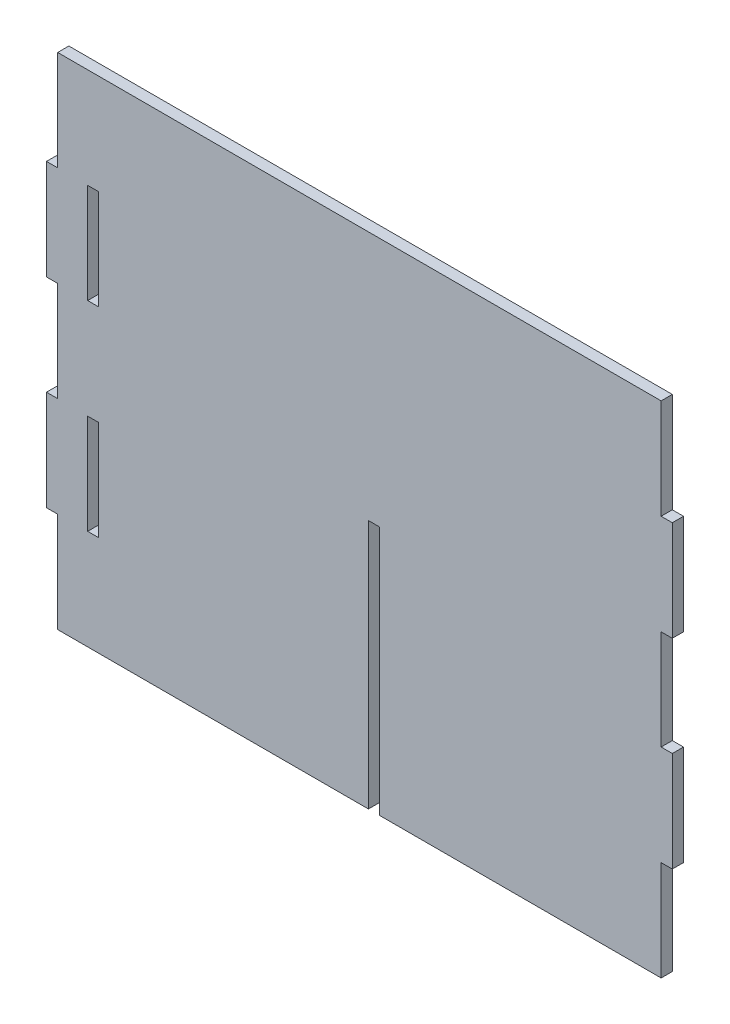
ISO-10303-21;
HEADER;
FILE_DESCRIPTION(('STEP AP214'),'2;1');
FILE_NAME('part.step','',(''),(''),'','','');
FILE_SCHEMA(('AUTOMOTIVE_DESIGN { 1 0 10303 214 1 1 1 1 }'));
ENDSEC;
DATA;
#1=APPLICATION_CONTEXT('core data for automotive mechanical design processes');
#2=APPLICATION_PROTOCOL_DEFINITION('international standard','automotive_design',2000,#1);
#3=PRODUCT_CONTEXT('',#1,'mechanical');
#4=PRODUCT('Part','Part','',(#3));
#5=PRODUCT_RELATED_PRODUCT_CATEGORY('part','',(#4));
#6=PRODUCT_DEFINITION_FORMATION('','',#4);
#7=PRODUCT_DEFINITION_CONTEXT('part definition',#1,'design');
#8=PRODUCT_DEFINITION('design','',#6,#7);
#9=PRODUCT_DEFINITION_SHAPE('','',#8);
#10=(LENGTH_UNIT() NAMED_UNIT(*) SI_UNIT(.MILLI.,.METRE.));
#11=(NAMED_UNIT(*) PLANE_ANGLE_UNIT() SI_UNIT($,.RADIAN.));
#12=(NAMED_UNIT(*) SI_UNIT($,.STERADIAN.) SOLID_ANGLE_UNIT());
#13=UNCERTAINTY_MEASURE_WITH_UNIT(LENGTH_MEASURE(1.E-05),#10,'distance_accuracy_value','');
#14=(GEOMETRIC_REPRESENTATION_CONTEXT(3) GLOBAL_UNCERTAINTY_ASSIGNED_CONTEXT((#13)) GLOBAL_UNIT_ASSIGNED_CONTEXT((#10,
#11,#12)) REPRESENTATION_CONTEXT('',''));
#15=CARTESIAN_POINT('',(0.,0.,0.));
#16=DIRECTION('',(0.,0.,1.));
#17=DIRECTION('',(1.,0.,0.));
#18=AXIS2_PLACEMENT_3D('',#15,#16,#17);
#19=CARTESIAN_POINT('',(-131.24686,24.17314,-386.827934387987));
#20=DIRECTION('',(0.,-1.,0.));
#21=DIRECTION('',(0.,0.,-1.));
#22=AXIS2_PLACEMENT_3D('',#19,#20,#21);
#23=PLANE('',#22);
#24=DIRECTION('',(0.,0.,1.));
#25=VECTOR('',#24,1.);
#26=CARTESIAN_POINT('',(-125.92814,24.17314,-386.827934387987));
#27=LINE('',#26,#25);
#28=CARTESIAN_POINT('',(-125.92814,24.17314,0.));
#29=VERTEX_POINT('',#28);
#30=CARTESIAN_POINT('',(-125.92814,24.17314,5.4));
#31=VERTEX_POINT('',#30);
#32=EDGE_CURVE('E318',#29,#31,#27,.T.);
#33=ORIENTED_EDGE('',*,*,#32,.F.);
#34=DIRECTION('',(-1.,0.,0.));
#35=VECTOR('',#34,1.);
#36=CARTESIAN_POINT('',(-131.24686,24.17314,0.));
#37=LINE('',#36,#35);
#38=CARTESIAN_POINT('',(-131.24686,24.17314,0.));
#39=VERTEX_POINT('',#38);
#40=EDGE_CURVE('E61',#29,#39,#37,.T.);
#41=ORIENTED_EDGE('',*,*,#40,.T.);
#42=DIRECTION('',(0.,0.,1.));
#43=VECTOR('',#42,1.);
#44=CARTESIAN_POINT('',(-131.24686,24.17314,-386.827934387987));
#45=LINE('',#44,#43);
#46=CARTESIAN_POINT('',(-131.24686,24.17314,5.4));
#47=VERTEX_POINT('',#46);
#48=EDGE_CURVE('E310',#39,#47,#45,.T.);
#49=ORIENTED_EDGE('',*,*,#48,.T.);
#50=DIRECTION('',(1.,0.,0.));
#51=VECTOR('',#50,1.);
#52=CARTESIAN_POINT('',(-131.24686,24.17314,5.4));
#53=LINE('',#52,#51);
#54=EDGE_CURVE('E298',#47,#31,#53,.T.);
#55=ORIENTED_EDGE('',*,*,#54,.T.);
#56=EDGE_LOOP('',(#33,#41,#49,#55));
#57=FACE_BOUND('',#56,.T.);
#58=ADVANCED_FACE('F41',(#57),#23,.F.);
#59=CARTESIAN_POINT('',(-125.92814,24.17314,-386.827934387987));
#60=DIRECTION('',(1.,0.,0.));
#61=DIRECTION('',(0.,1.,0.));
#62=AXIS2_PLACEMENT_3D('',#59,#60,#61);
#63=PLANE('',#62);
#64=DIRECTION('',(0.,0.,1.));
#65=VECTOR('',#64,1.);
#66=CARTESIAN_POINT('',(-125.92814,72.35686,-386.827934387987));
#67=LINE('',#66,#65);
#68=CARTESIAN_POINT('',(-125.92814,72.35686,0.));
#69=VERTEX_POINT('',#68);
#70=CARTESIAN_POINT('',(-125.92814,72.35686,5.4));
#71=VERTEX_POINT('',#70);
#72=EDGE_CURVE('E315',#69,#71,#67,.T.);
#73=ORIENTED_EDGE('',*,*,#72,.F.);
#74=DIRECTION('',(0.,-1.,0.));
#75=VECTOR('',#74,1.);
#76=CARTESIAN_POINT('',(-125.92814,24.17314,0.));
#77=LINE('',#76,#75);
#78=EDGE_CURVE('E52',#69,#29,#77,.T.);
#79=ORIENTED_EDGE('',*,*,#78,.T.);
#80=ORIENTED_EDGE('',*,*,#32,.T.);
#81=DIRECTION('',(0.,1.,0.));
#82=VECTOR('',#81,1.);
#83=CARTESIAN_POINT('',(-125.92814,24.17314,5.4));
#84=LINE('',#83,#82);
#85=EDGE_CURVE('E302',#31,#71,#84,.T.);
#86=ORIENTED_EDGE('',*,*,#85,.T.);
#87=EDGE_LOOP('',(#73,#79,#80,#86));
#88=FACE_BOUND('',#87,.T.);
#89=ADVANCED_FACE('F712',(#88),#63,.F.);
#90=CARTESIAN_POINT('',(-125.92814,72.35686,-386.827934387987));
#91=DIRECTION('',(0.,1.,0.));
#92=DIRECTION('',(-1.,0.,0.));
#93=AXIS2_PLACEMENT_3D('',#90,#91,#92);
#94=PLANE('',#93);
#95=DIRECTION('',(0.,0.,1.));
#96=VECTOR('',#95,1.);
#97=CARTESIAN_POINT('',(-131.24686,72.35686,-386.827934387987));
#98=LINE('',#97,#96);
#99=CARTESIAN_POINT('',(-131.24686,72.35686,0.));
#100=VERTEX_POINT('',#99);
#101=CARTESIAN_POINT('',(-131.24686,72.35686,5.4));
#102=VERTEX_POINT('',#101);
#103=EDGE_CURVE('E311',#100,#102,#98,.T.);
#104=ORIENTED_EDGE('',*,*,#103,.F.);
#105=DIRECTION('',(1.,0.,0.));
#106=VECTOR('',#105,1.);
#107=CARTESIAN_POINT('',(-125.92814,72.35686,0.));
#108=LINE('',#107,#106);
#109=EDGE_CURVE('E81',#100,#69,#108,.T.);
#110=ORIENTED_EDGE('',*,*,#109,.T.);
#111=ORIENTED_EDGE('',*,*,#72,.T.);
#112=DIRECTION('',(-1.,0.,0.));
#113=VECTOR('',#112,1.);
#114=CARTESIAN_POINT('',(-125.92814,72.35686,5.4));
#115=LINE('',#114,#113);
#116=EDGE_CURVE('E306',#71,#102,#115,.T.);
#117=ORIENTED_EDGE('',*,*,#116,.T.);
#118=EDGE_LOOP('',(#104,#110,#111,#117));
#119=FACE_BOUND('',#118,.T.);
#120=ADVANCED_FACE('F718',(#119),#94,.F.);
#121=CARTESIAN_POINT('',(-131.24686,72.35686,-386.827934387987));
#122=DIRECTION('',(-1.,0.,0.));
#123=DIRECTION('',(0.,0.,1.));
#124=AXIS2_PLACEMENT_3D('',#121,#122,#123);
#125=PLANE('',#124);
#126=ORIENTED_EDGE('',*,*,#48,.F.);
#127=DIRECTION('',(0.,1.,0.));
#128=VECTOR('',#127,1.);
#129=CARTESIAN_POINT('',(-131.24686,72.35686,0.));
#130=LINE('',#129,#128);
#131=EDGE_CURVE('E534',#39,#100,#130,.T.);
#132=ORIENTED_EDGE('',*,*,#131,.T.);
#133=ORIENTED_EDGE('',*,*,#103,.T.);
#134=DIRECTION('',(0.,-1.,0.));
#135=VECTOR('',#134,1.);
#136=CARTESIAN_POINT('',(-131.24686,72.35686,5.4));
#137=LINE('',#136,#135);
#138=EDGE_CURVE('E290',#102,#47,#137,.T.);
#139=ORIENTED_EDGE('',*,*,#138,.T.);
#140=EDGE_LOOP('',(#126,#132,#133,#139));
#141=FACE_BOUND('',#140,.T.);
#142=ADVANCED_FACE('F724',(#141),#125,.F.);
#143=CARTESIAN_POINT('',(0.,0.,0.));
#144=DIRECTION('',(0.,0.,1.));
#145=DIRECTION('',(1.,0.,0.));
#146=AXIS2_PLACEMENT_3D('',#143,#144,#145);
#147=PLANE('',#146);
#148=DIRECTION('',(-1.,0.,0.));
#149=VECTOR('',#148,1.);
#150=CARTESIAN_POINT('',(-131.24686,-72.35686,0.));
#151=LINE('',#150,#149);
#152=CARTESIAN_POINT('',(-125.92814,-72.3568600000001,0.));
#153=VERTEX_POINT('',#152);
#154=CARTESIAN_POINT('',(-131.24686,-72.35686,0.));
#155=VERTEX_POINT('',#154);
#156=EDGE_CURVE('E45',#153,#155,#151,.T.);
#157=ORIENTED_EDGE('',*,*,#156,.F.);
#158=DIRECTION('',(0.,-1.,0.));
#159=VECTOR('',#158,1.);
#160=CARTESIAN_POINT('',(-125.92814,-72.3568600000001,0.));
#161=LINE('',#160,#159);
#162=CARTESIAN_POINT('',(-125.92814,-24.17314,0.));
#163=VERTEX_POINT('',#162);
#164=EDGE_CURVE('E75',#163,#153,#161,.T.);
#165=ORIENTED_EDGE('',*,*,#164,.F.);
#166=DIRECTION('',(1.,0.,0.));
#167=VECTOR('',#166,1.);
#168=CARTESIAN_POINT('',(-125.92814,-24.17314,0.));
#169=LINE('',#168,#167);
#170=CARTESIAN_POINT('',(-131.24686,-24.17314,0.));
#171=VERTEX_POINT('',#170);
#172=EDGE_CURVE('E529',#171,#163,#169,.T.);
#173=ORIENTED_EDGE('',*,*,#172,.F.);
#174=DIRECTION('',(0.,1.,0.));
#175=VECTOR('',#174,1.);
#176=CARTESIAN_POINT('',(-131.24686,-24.17314,0.));
#177=LINE('',#176,#175);
#178=EDGE_CURVE('E516',#155,#171,#177,.T.);
#179=ORIENTED_EDGE('',*,*,#178,.F.);
#180=EDGE_LOOP('',(#157,#165,#173,#179));
#181=FACE_BOUND('',#180,.T.);
#182=DIRECTION('',(0.,1.,0.));
#183=VECTOR('',#182,1.);
#184=CARTESIAN_POINT('',(-145.72814,-72.43814,0.));
#185=LINE('',#184,#183);
#186=CARTESIAN_POINT('',(-145.72814,-120.70314,0.));
#187=VERTEX_POINT('',#186);
#188=CARTESIAN_POINT('',(-145.72814,-72.43814,0.));
#189=VERTEX_POINT('',#188);
#190=EDGE_CURVE('E495',#187,#189,#185,.T.);
#191=ORIENTED_EDGE('',*,*,#190,.T.);
#192=DIRECTION('',(-1.,0.,0.));
#193=VECTOR('',#192,1.);
#194=CARTESIAN_POINT('',(-151.12814,-72.43814,0.));
#195=LINE('',#194,#193);
#196=CARTESIAN_POINT('',(-151.12814,-72.43814,0.));
#197=VERTEX_POINT('',#196);
#198=EDGE_CURVE('E508',#189,#197,#195,.T.);
#199=ORIENTED_EDGE('',*,*,#198,.T.);
#200=DIRECTION('',(0.,1.,0.));
#201=VECTOR('',#200,1.);
#202=CARTESIAN_POINT('',(-151.12814,-24.09186,0.));
#203=LINE('',#202,#201);
#204=CARTESIAN_POINT('',(-151.12814,-24.09186,0.));
#205=VERTEX_POINT('',#204);
#206=EDGE_CURVE('E512',#197,#205,#203,.T.);
#207=ORIENTED_EDGE('',*,*,#206,.T.);
#208=DIRECTION('',(1.,0.,0.));
#209=VECTOR('',#208,1.);
#210=CARTESIAN_POINT('',(-145.72814,-24.09186,0.));
#211=LINE('',#210,#209);
#212=CARTESIAN_POINT('',(-145.72814,-24.09186,0.));
#213=VERTEX_POINT('',#212);
#214=EDGE_CURVE('E518',#205,#213,#211,.T.);
#215=ORIENTED_EDGE('',*,*,#214,.T.);
#216=DIRECTION('',(0.,1.,0.));
#217=VECTOR('',#216,1.);
#218=CARTESIAN_POINT('',(-145.72814,24.09186,0.));
#219=LINE('',#218,#217);
#220=CARTESIAN_POINT('',(-145.72814,24.09186,0.));
#221=VERTEX_POINT('',#220);
#222=EDGE_CURVE('E601',#213,#221,#219,.T.);
#223=ORIENTED_EDGE('',*,*,#222,.T.);
#224=DIRECTION('',(-1.,0.,0.));
#225=VECTOR('',#224,1.);
#226=CARTESIAN_POINT('',(-151.12814,24.09186,0.));
#227=LINE('',#226,#225);
#228=CARTESIAN_POINT('',(-151.12814,24.09186,0.));
#229=VERTEX_POINT('',#228);
#230=EDGE_CURVE('E598',#221,#229,#227,.T.);
#231=ORIENTED_EDGE('',*,*,#230,.T.);
#232=DIRECTION('',(0.,1.,0.));
#233=VECTOR('',#232,1.);
#234=CARTESIAN_POINT('',(-151.12814,72.43814,0.));
#235=LINE('',#234,#233);
#236=CARTESIAN_POINT('',(-151.12814,72.43814,0.));
#237=VERTEX_POINT('',#236);
#238=EDGE_CURVE('E595',#229,#237,#235,.T.);
#239=ORIENTED_EDGE('',*,*,#238,.T.);
#240=DIRECTION('',(1.,0.,0.));
#241=VECTOR('',#240,1.);
#242=CARTESIAN_POINT('',(-145.72814,72.43814,0.));
#243=LINE('',#242,#241);
#244=CARTESIAN_POINT('',(-145.72814,72.43814,0.));
#245=VERTEX_POINT('',#244);
#246=EDGE_CURVE('E592',#237,#245,#243,.T.);
#247=ORIENTED_EDGE('',*,*,#246,.T.);
#248=DIRECTION('',(0.,1.,0.));
#249=VECTOR('',#248,1.);
#250=CARTESIAN_POINT('',(-145.72814,120.70314,0.));
#251=LINE('',#250,#249);
#252=CARTESIAN_POINT('',(-145.72814,120.70314,0.));
#253=VERTEX_POINT('',#252);
#254=EDGE_CURVE('E589',#245,#253,#251,.T.);
#255=ORIENTED_EDGE('',*,*,#254,.T.);
#256=DIRECTION('',(1.,0.,0.));
#257=VECTOR('',#256,1.);
#258=CARTESIAN_POINT('',(145.72814,120.70314,0.));
#259=LINE('',#258,#257);
#260=CARTESIAN_POINT('',(145.72814,120.70314,0.));
#261=VERTEX_POINT('',#260);
#262=EDGE_CURVE('E586',#253,#261,#259,.T.);
#263=ORIENTED_EDGE('',*,*,#262,.T.);
#264=DIRECTION('',(0.,-1.,0.));
#265=VECTOR('',#264,1.);
#266=CARTESIAN_POINT('',(145.72814,72.43814,0.));
#267=LINE('',#266,#265);
#268=CARTESIAN_POINT('',(145.72814,72.43814,0.));
#269=VERTEX_POINT('',#268);
#270=EDGE_CURVE('E583',#261,#269,#267,.T.);
#271=ORIENTED_EDGE('',*,*,#270,.T.);
#272=DIRECTION('',(1.,0.,0.));
#273=VECTOR('',#272,1.);
#274=CARTESIAN_POINT('',(151.12814,72.43814,0.));
#275=LINE('',#274,#273);
#276=CARTESIAN_POINT('',(151.12814,72.43814,0.));
#277=VERTEX_POINT('',#276);
#278=EDGE_CURVE('E580',#269,#277,#275,.T.);
#279=ORIENTED_EDGE('',*,*,#278,.T.);
#280=DIRECTION('',(0.,-1.,0.));
#281=VECTOR('',#280,1.);
#282=CARTESIAN_POINT('',(151.12814,24.09186,0.));
#283=LINE('',#282,#281);
#284=CARTESIAN_POINT('',(151.12814,24.09186,0.));
#285=VERTEX_POINT('',#284);
#286=EDGE_CURVE('E577',#277,#285,#283,.T.);
#287=ORIENTED_EDGE('',*,*,#286,.T.);
#288=DIRECTION('',(-1.,0.,0.));
#289=VECTOR('',#288,1.);
#290=CARTESIAN_POINT('',(145.72814,24.09186,0.));
#291=LINE('',#290,#289);
#292=CARTESIAN_POINT('',(145.72814,24.09186,0.));
#293=VERTEX_POINT('',#292);
#294=EDGE_CURVE('E574',#285,#293,#291,.T.);
#295=ORIENTED_EDGE('',*,*,#294,.T.);
#296=DIRECTION('',(0.,-1.,0.));
#297=VECTOR('',#296,1.);
#298=CARTESIAN_POINT('',(145.72814,-24.09186,0.));
#299=LINE('',#298,#297);
#300=CARTESIAN_POINT('',(145.72814,-24.09186,0.));
#301=VERTEX_POINT('',#300);
#302=EDGE_CURVE('E571',#293,#301,#299,.T.);
#303=ORIENTED_EDGE('',*,*,#302,.T.);
#304=DIRECTION('',(1.,0.,0.));
#305=VECTOR('',#304,1.);
#306=CARTESIAN_POINT('',(151.12814,-24.09186,0.));
#307=LINE('',#306,#305);
#308=CARTESIAN_POINT('',(151.12814,-24.09186,0.));
#309=VERTEX_POINT('',#308);
#310=EDGE_CURVE('E568',#301,#309,#307,.T.);
#311=ORIENTED_EDGE('',*,*,#310,.T.);
#312=DIRECTION('',(0.,-1.,0.));
#313=VECTOR('',#312,1.);
#314=CARTESIAN_POINT('',(151.12814,-72.43814,0.));
#315=LINE('',#314,#313);
#316=CARTESIAN_POINT('',(151.12814,-72.43814,0.));
#317=VERTEX_POINT('',#316);
#318=EDGE_CURVE('E565',#309,#317,#315,.T.);
#319=ORIENTED_EDGE('',*,*,#318,.T.);
#320=DIRECTION('',(-1.,0.,0.));
#321=VECTOR('',#320,1.);
#322=CARTESIAN_POINT('',(145.72814,-72.43814,0.));
#323=LINE('',#322,#321);
#324=CARTESIAN_POINT('',(145.72814,-72.43814,0.));
#325=VERTEX_POINT('',#324);
#326=EDGE_CURVE('E562',#317,#325,#323,.T.);
#327=ORIENTED_EDGE('',*,*,#326,.T.);
#328=DIRECTION('',(0.,-1.,0.));
#329=VECTOR('',#328,1.);
#330=CARTESIAN_POINT('',(145.72814,-120.70314,0.));
#331=LINE('',#330,#329);
#332=CARTESIAN_POINT('',(145.72814,-120.70314,0.));
#333=VERTEX_POINT('',#332);
#334=EDGE_CURVE('E559',#325,#333,#331,.T.);
#335=ORIENTED_EDGE('',*,*,#334,.T.);
#336=DIRECTION('',(-1.,0.,0.));
#337=VECTOR('',#336,1.);
#338=CARTESIAN_POINT('',(9.67185999999998,-120.70314,0.));
#339=LINE('',#338,#337);
#340=CARTESIAN_POINT('',(9.67185999999998,-120.70314,0.));
#341=VERTEX_POINT('',#340);
#342=EDGE_CURVE('E556',#333,#341,#339,.T.);
#343=ORIENTED_EDGE('',*,*,#342,.T.);
#344=DIRECTION('',(0.,1.,0.));
#345=VECTOR('',#344,1.);
#346=CARTESIAN_POINT('',(9.67185999999998,-0.0406400000000138,0.));
#347=LINE('',#346,#345);
#348=CARTESIAN_POINT('',(9.67185999999998,-0.0406400000000138,0.));
#349=VERTEX_POINT('',#348);
#350=EDGE_CURVE('E553',#341,#349,#347,.T.);
#351=ORIENTED_EDGE('',*,*,#350,.T.);
#352=DIRECTION('',(-1.,0.,0.));
#353=VECTOR('',#352,1.);
#354=CARTESIAN_POINT('',(4.35313999999998,-0.0406400000000001,0.));
#355=LINE('',#354,#353);
#356=CARTESIAN_POINT('',(4.35313999999998,-0.0406400000000084,0.));
#357=VERTEX_POINT('',#356);
#358=EDGE_CURVE('E550',#349,#357,#355,.T.);
#359=ORIENTED_EDGE('',*,*,#358,.T.);
#360=DIRECTION('',(0.,-1.,0.));
#361=VECTOR('',#360,1.);
#362=CARTESIAN_POINT('',(4.35313999999998,-120.70314,0.));
#363=LINE('',#362,#361);
#364=CARTESIAN_POINT('',(4.35313999999998,-120.70314,0.));
#365=VERTEX_POINT('',#364);
#366=EDGE_CURVE('E540',#357,#365,#363,.T.);
#367=ORIENTED_EDGE('',*,*,#366,.T.);
#368=DIRECTION('',(-1.,0.,0.));
#369=VECTOR('',#368,1.);
#370=CARTESIAN_POINT('',(-145.72814,-120.70314,0.));
#371=LINE('',#370,#369);
#372=EDGE_CURVE('E11',#365,#187,#371,.T.);
#373=ORIENTED_EDGE('',*,*,#372,.T.);
#374=EDGE_LOOP('',(#191,#199,#207,#215,#223,#231,#239,#247,#255,#263,#271,#279,#287,#295,#303,
#311,#319,#327,#335,#343,#351,#359,#367,#373));
#375=FACE_BOUND('',#374,.T.);
#376=ORIENTED_EDGE('',*,*,#40,.F.);
#377=ORIENTED_EDGE('',*,*,#78,.F.);
#378=ORIENTED_EDGE('',*,*,#109,.F.);
#379=ORIENTED_EDGE('',*,*,#131,.F.);
#380=EDGE_LOOP('',(#376,#377,#378,#379));
#381=FACE_BOUND('',#380,.T.);
#382=ADVANCED_FACE('F43',(#181,#375,#381),#147,.F.);
#383=CARTESIAN_POINT('',(-131.24686,-24.17314,-386.827934387987));
#384=DIRECTION('',(-1.,0.,0.));
#385=DIRECTION('',(0.,0.,1.));
#386=AXIS2_PLACEMENT_3D('',#383,#384,#385);
#387=PLANE('',#386);
#388=DIRECTION('',(0.,0.,1.));
#389=VECTOR('',#388,1.);
#390=CARTESIAN_POINT('',(-131.24686,-72.35686,-386.827934387987));
#391=LINE('',#390,#389);
#392=CARTESIAN_POINT('',(-131.24686,-72.35686,5.4));
#393=VERTEX_POINT('',#392);
#394=EDGE_CURVE('E265',#155,#393,#391,.T.);
#395=ORIENTED_EDGE('',*,*,#394,.F.);
#396=ORIENTED_EDGE('',*,*,#178,.T.);
#397=DIRECTION('',(0.,0.,1.));
#398=VECTOR('',#397,1.);
#399=CARTESIAN_POINT('',(-131.24686,-24.17314,-386.827934387987));
#400=LINE('',#399,#398);
#401=CARTESIAN_POINT('',(-131.24686,-24.17314,5.4));
#402=VERTEX_POINT('',#401);
#403=EDGE_CURVE('E287',#171,#402,#400,.T.);
#404=ORIENTED_EDGE('',*,*,#403,.T.);
#405=DIRECTION('',(0.,-1.,0.));
#406=VECTOR('',#405,1.);
#407=CARTESIAN_POINT('',(-131.24686,-24.17314,5.4));
#408=LINE('',#407,#406);
#409=EDGE_CURVE('E275',#402,#393,#408,.T.);
#410=ORIENTED_EDGE('',*,*,#409,.T.);
#411=EDGE_LOOP('',(#395,#396,#404,#410));
#412=FACE_BOUND('',#411,.T.);
#413=ADVANCED_FACE('F523',(#412),#387,.F.);
#414=CARTESIAN_POINT('',(-125.92814,-24.17314,-386.827934387987));
#415=DIRECTION('',(0.,1.,0.));
#416=DIRECTION('',(-1.,0.,0.));
#417=AXIS2_PLACEMENT_3D('',#414,#415,#416);
#418=PLANE('',#417);
#419=ORIENTED_EDGE('',*,*,#403,.F.);
#420=ORIENTED_EDGE('',*,*,#172,.T.);
#421=DIRECTION('',(0.,0.,1.));
#422=VECTOR('',#421,1.);
#423=CARTESIAN_POINT('',(-125.92814,-24.17314,-386.827934387987));
#424=LINE('',#423,#422);
#425=CARTESIAN_POINT('',(-125.92814,-24.17314,5.4));
#426=VERTEX_POINT('',#425);
#427=EDGE_CURVE('E264',#163,#426,#424,.T.);
#428=ORIENTED_EDGE('',*,*,#427,.T.);
#429=DIRECTION('',(-1.,0.,0.));
#430=VECTOR('',#429,1.);
#431=CARTESIAN_POINT('',(-125.92814,-24.17314,5.4));
#432=LINE('',#431,#430);
#433=EDGE_CURVE('E280',#426,#402,#432,.T.);
#434=ORIENTED_EDGE('',*,*,#433,.T.);
#435=EDGE_LOOP('',(#419,#420,#428,#434));
#436=FACE_BOUND('',#435,.T.);
#437=ADVANCED_FACE('F528',(#436),#418,.F.);
#438=CARTESIAN_POINT('',(-125.92814,-72.3568600000001,-386.827934387987));
#439=DIRECTION('',(1.,0.,0.));
#440=DIRECTION('',(0.,1.,0.));
#441=AXIS2_PLACEMENT_3D('',#438,#439,#440);
#442=PLANE('',#441);
#443=ORIENTED_EDGE('',*,*,#427,.F.);
#444=ORIENTED_EDGE('',*,*,#164,.T.);
#445=DIRECTION('',(0.,0.,1.));
#446=VECTOR('',#445,1.);
#447=CARTESIAN_POINT('',(-125.92814,-72.3568600000001,-386.827934387987));
#448=LINE('',#447,#446);
#449=CARTESIAN_POINT('',(-125.92814,-72.3568600000001,5.4));
#450=VERTEX_POINT('',#449);
#451=EDGE_CURVE('E256',#153,#450,#448,.T.);
#452=ORIENTED_EDGE('',*,*,#451,.T.);
#453=DIRECTION('',(0.,1.,0.));
#454=VECTOR('',#453,1.);
#455=CARTESIAN_POINT('',(-125.92814,-72.3568600000001,5.4));
#456=LINE('',#455,#454);
#457=EDGE_CURVE('E260',#450,#426,#456,.T.);
#458=ORIENTED_EDGE('',*,*,#457,.T.);
#459=EDGE_LOOP('',(#443,#444,#452,#458));
#460=FACE_BOUND('',#459,.T.);
#461=ADVANCED_FACE('F258',(#460),#442,.F.);
#462=CARTESIAN_POINT('',(-131.24686,-72.35686,-386.827934387987));
#463=DIRECTION('',(0.,-1.,0.));
#464=DIRECTION('',(1.,0.,0.));
#465=AXIS2_PLACEMENT_3D('',#462,#463,#464);
#466=PLANE('',#465);
#467=ORIENTED_EDGE('',*,*,#451,.F.);
#468=ORIENTED_EDGE('',*,*,#156,.T.);
#469=ORIENTED_EDGE('',*,*,#394,.T.);
#470=DIRECTION('',(1.,0.,0.));
#471=VECTOR('',#470,1.);
#472=CARTESIAN_POINT('',(-131.24686,-72.35686,5.4));
#473=LINE('',#472,#471);
#474=EDGE_CURVE('E268',#393,#450,#473,.T.);
#475=ORIENTED_EDGE('',*,*,#474,.T.);
#476=EDGE_LOOP('',(#467,#468,#469,#475));
#477=FACE_BOUND('',#476,.T.);
#478=ADVANCED_FACE('F269',(#477),#466,.F.);
#479=CARTESIAN_POINT('',(0.,0.,5.4));
#480=DIRECTION('',(0.,0.,1.));
#481=DIRECTION('',(1.,0.,0.));
#482=AXIS2_PLACEMENT_3D('',#479,#480,#481);
#483=PLANE('',#482);
#484=ORIENTED_EDGE('',*,*,#409,.F.);
#485=ORIENTED_EDGE('',*,*,#433,.F.);
#486=ORIENTED_EDGE('',*,*,#457,.F.);
#487=ORIENTED_EDGE('',*,*,#474,.F.);
#488=EDGE_LOOP('',(#484,#485,#486,#487));
#489=FACE_BOUND('',#488,.T.);
#490=DIRECTION('',(0.,-1.,0.));
#491=VECTOR('',#490,1.);
#492=CARTESIAN_POINT('',(-145.72814,-72.43814,5.4));
#493=LINE('',#492,#491);
#494=CARTESIAN_POINT('',(-145.72814,-72.43814,5.4));
#495=VERTEX_POINT('',#494);
#496=CARTESIAN_POINT('',(-145.72814,-120.70314,5.4));
#497=VERTEX_POINT('',#496);
#498=EDGE_CURVE('E314',#495,#497,#493,.T.);
#499=ORIENTED_EDGE('',*,*,#498,.T.);
#500=DIRECTION('',(1.,0.,0.));
#501=VECTOR('',#500,1.);
#502=CARTESIAN_POINT('',(-145.72814,-120.70314,5.4));
#503=LINE('',#502,#501);
#504=CARTESIAN_POINT('',(4.35313999999998,-120.70314,5.4));
#505=VERTEX_POINT('',#504);
#506=EDGE_CURVE('E326',#497,#505,#503,.T.);
#507=ORIENTED_EDGE('',*,*,#506,.T.);
#508=DIRECTION('',(0.,1.,0.));
#509=VECTOR('',#508,1.);
#510=CARTESIAN_POINT('',(4.35313999999998,-120.70314,5.4));
#511=LINE('',#510,#509);
#512=CARTESIAN_POINT('',(4.35313999999998,-0.0406400000000001,5.4));
#513=VERTEX_POINT('',#512);
#514=EDGE_CURVE('E330',#505,#513,#511,.T.);
#515=ORIENTED_EDGE('',*,*,#514,.T.);
#516=DIRECTION('',(1.,0.,0.));
#517=VECTOR('',#516,1.);
#518=CARTESIAN_POINT('',(4.35313999999998,-0.0406400000000001,5.4));
#519=LINE('',#518,#517);
#520=CARTESIAN_POINT('',(9.67185999999998,-0.0406400000000138,5.4));
#521=VERTEX_POINT('',#520);
#522=EDGE_CURVE('E334',#513,#521,#519,.T.);
#523=ORIENTED_EDGE('',*,*,#522,.T.);
#524=DIRECTION('',(0.,-1.,0.));
#525=VECTOR('',#524,1.);
#526=CARTESIAN_POINT('',(9.67185999999998,-0.0406400000000138,5.4));
#527=LINE('',#526,#525);
#528=CARTESIAN_POINT('',(9.67185999999998,-120.70314,5.4));
#529=VERTEX_POINT('',#528);
#530=EDGE_CURVE('E338',#521,#529,#527,.T.);
#531=ORIENTED_EDGE('',*,*,#530,.T.);
#532=DIRECTION('',(1.,0.,0.));
#533=VECTOR('',#532,1.);
#534=CARTESIAN_POINT('',(9.67185999999998,-120.70314,5.4));
#535=LINE('',#534,#533);
#536=CARTESIAN_POINT('',(145.72814,-120.70314,5.4));
#537=VERTEX_POINT('',#536);
#538=EDGE_CURVE('E342',#529,#537,#535,.T.);
#539=ORIENTED_EDGE('',*,*,#538,.T.);
#540=DIRECTION('',(0.,1.,0.));
#541=VECTOR('',#540,1.);
#542=CARTESIAN_POINT('',(145.72814,-120.70314,5.4));
#543=LINE('',#542,#541);
#544=CARTESIAN_POINT('',(145.72814,-72.43814,5.4));
#545=VERTEX_POINT('',#544);
#546=EDGE_CURVE('E346',#537,#545,#543,.T.);
#547=ORIENTED_EDGE('',*,*,#546,.T.);
#548=DIRECTION('',(1.,0.,0.));
#549=VECTOR('',#548,1.);
#550=CARTESIAN_POINT('',(145.72814,-72.43814,5.4));
#551=LINE('',#550,#549);
#552=CARTESIAN_POINT('',(151.12814,-72.43814,5.4));
#553=VERTEX_POINT('',#552);
#554=EDGE_CURVE('E350',#545,#553,#551,.T.);
#555=ORIENTED_EDGE('',*,*,#554,.T.);
#556=DIRECTION('',(0.,1.,0.));
#557=VECTOR('',#556,1.);
#558=CARTESIAN_POINT('',(151.12814,-72.43814,5.4));
#559=LINE('',#558,#557);
#560=CARTESIAN_POINT('',(151.12814,-24.09186,5.4));
#561=VERTEX_POINT('',#560);
#562=EDGE_CURVE('E354',#553,#561,#559,.T.);
#563=ORIENTED_EDGE('',*,*,#562,.T.);
#564=DIRECTION('',(-1.,0.,0.));
#565=VECTOR('',#564,1.);
#566=CARTESIAN_POINT('',(151.12814,-24.09186,5.4));
#567=LINE('',#566,#565);
#568=CARTESIAN_POINT('',(145.72814,-24.09186,5.4));
#569=VERTEX_POINT('',#568);
#570=EDGE_CURVE('E358',#561,#569,#567,.T.);
#571=ORIENTED_EDGE('',*,*,#570,.T.);
#572=DIRECTION('',(0.,1.,0.));
#573=VECTOR('',#572,1.);
#574=CARTESIAN_POINT('',(145.72814,-24.09186,5.4));
#575=LINE('',#574,#573);
#576=CARTESIAN_POINT('',(145.72814,24.09186,5.4));
#577=VERTEX_POINT('',#576);
#578=EDGE_CURVE('E362',#569,#577,#575,.T.);
#579=ORIENTED_EDGE('',*,*,#578,.T.);
#580=DIRECTION('',(1.,0.,0.));
#581=VECTOR('',#580,1.);
#582=CARTESIAN_POINT('',(145.72814,24.09186,5.4));
#583=LINE('',#582,#581);
#584=CARTESIAN_POINT('',(151.12814,24.09186,5.4));
#585=VERTEX_POINT('',#584);
#586=EDGE_CURVE('E366',#577,#585,#583,.T.);
#587=ORIENTED_EDGE('',*,*,#586,.T.);
#588=DIRECTION('',(0.,1.,0.));
#589=VECTOR('',#588,1.);
#590=CARTESIAN_POINT('',(151.12814,24.09186,5.4));
#591=LINE('',#590,#589);
#592=CARTESIAN_POINT('',(151.12814,72.43814,5.4));
#593=VERTEX_POINT('',#592);
#594=EDGE_CURVE('E370',#585,#593,#591,.T.);
#595=ORIENTED_EDGE('',*,*,#594,.T.);
#596=DIRECTION('',(-1.,0.,0.));
#597=VECTOR('',#596,1.);
#598=CARTESIAN_POINT('',(151.12814,72.43814,5.4));
#599=LINE('',#598,#597);
#600=CARTESIAN_POINT('',(145.72814,72.43814,5.4));
#601=VERTEX_POINT('',#600);
#602=EDGE_CURVE('E374',#593,#601,#599,.T.);
#603=ORIENTED_EDGE('',*,*,#602,.T.);
#604=DIRECTION('',(0.,1.,0.));
#605=VECTOR('',#604,1.);
#606=CARTESIAN_POINT('',(145.72814,72.43814,5.4));
#607=LINE('',#606,#605);
#608=CARTESIAN_POINT('',(145.72814,120.70314,5.4));
#609=VERTEX_POINT('',#608);
#610=EDGE_CURVE('E378',#601,#609,#607,.T.);
#611=ORIENTED_EDGE('',*,*,#610,.T.);
#612=DIRECTION('',(-1.,0.,0.));
#613=VECTOR('',#612,1.);
#614=CARTESIAN_POINT('',(145.72814,120.70314,5.4));
#615=LINE('',#614,#613);
#616=CARTESIAN_POINT('',(-145.72814,120.70314,5.4));
#617=VERTEX_POINT('',#616);
#618=EDGE_CURVE('E382',#609,#617,#615,.T.);
#619=ORIENTED_EDGE('',*,*,#618,.T.);
#620=DIRECTION('',(0.,-1.,0.));
#621=VECTOR('',#620,1.);
#622=CARTESIAN_POINT('',(-145.72814,120.70314,5.4));
#623=LINE('',#622,#621);
#624=CARTESIAN_POINT('',(-145.72814,72.43814,5.4));
#625=VERTEX_POINT('',#624);
#626=EDGE_CURVE('E386',#617,#625,#623,.T.);
#627=ORIENTED_EDGE('',*,*,#626,.T.);
#628=DIRECTION('',(-1.,0.,0.));
#629=VECTOR('',#628,1.);
#630=CARTESIAN_POINT('',(-145.72814,72.43814,5.4));
#631=LINE('',#630,#629);
#632=CARTESIAN_POINT('',(-151.12814,72.43814,5.4));
#633=VERTEX_POINT('',#632);
#634=EDGE_CURVE('E390',#625,#633,#631,.T.);
#635=ORIENTED_EDGE('',*,*,#634,.T.);
#636=DIRECTION('',(0.,-1.,0.));
#637=VECTOR('',#636,1.);
#638=CARTESIAN_POINT('',(-151.12814,72.43814,5.4));
#639=LINE('',#638,#637);
#640=CARTESIAN_POINT('',(-151.12814,24.09186,5.4));
#641=VERTEX_POINT('',#640);
#642=EDGE_CURVE('E394',#633,#641,#639,.T.);
#643=ORIENTED_EDGE('',*,*,#642,.T.);
#644=DIRECTION('',(1.,0.,0.));
#645=VECTOR('',#644,1.);
#646=CARTESIAN_POINT('',(-151.12814,24.09186,5.4));
#647=LINE('',#646,#645);
#648=CARTESIAN_POINT('',(-145.72814,24.09186,5.4));
#649=VERTEX_POINT('',#648);
#650=EDGE_CURVE('E398',#641,#649,#647,.T.);
#651=ORIENTED_EDGE('',*,*,#650,.T.);
#652=DIRECTION('',(0.,-1.,0.));
#653=VECTOR('',#652,1.);
#654=CARTESIAN_POINT('',(-145.72814,24.09186,5.4));
#655=LINE('',#654,#653);
#656=CARTESIAN_POINT('',(-145.72814,-24.09186,5.4));
#657=VERTEX_POINT('',#656);
#658=EDGE_CURVE('E402',#649,#657,#655,.T.);
#659=ORIENTED_EDGE('',*,*,#658,.T.);
#660=DIRECTION('',(-1.,0.,0.));
#661=VECTOR('',#660,1.);
#662=CARTESIAN_POINT('',(-145.72814,-24.09186,5.4));
#663=LINE('',#662,#661);
#664=CARTESIAN_POINT('',(-151.12814,-24.09186,5.4));
#665=VERTEX_POINT('',#664);
#666=EDGE_CURVE('E406',#657,#665,#663,.T.);
#667=ORIENTED_EDGE('',*,*,#666,.T.);
#668=DIRECTION('',(0.,-1.,0.));
#669=VECTOR('',#668,1.);
#670=CARTESIAN_POINT('',(-151.12814,-24.09186,5.4));
#671=LINE('',#670,#669);
#672=CARTESIAN_POINT('',(-151.12814,-72.43814,5.4));
#673=VERTEX_POINT('',#672);
#674=EDGE_CURVE('E410',#665,#673,#671,.T.);
#675=ORIENTED_EDGE('',*,*,#674,.T.);
#676=DIRECTION('',(1.,0.,0.));
#677=VECTOR('',#676,1.);
#678=CARTESIAN_POINT('',(-151.12814,-72.43814,5.4));
#679=LINE('',#678,#677);
#680=EDGE_CURVE('E414',#673,#495,#679,.T.);
#681=ORIENTED_EDGE('',*,*,#680,.T.);
#682=EDGE_LOOP('',(#499,#507,#515,#523,#531,#539,#547,#555,#563,#571,#579,#587,#595,#603,#611,
#619,#627,#635,#643,#651,#659,#667,#675,#681));
#683=FACE_BOUND('',#682,.T.);
#684=ORIENTED_EDGE('',*,*,#138,.F.);
#685=ORIENTED_EDGE('',*,*,#116,.F.);
#686=ORIENTED_EDGE('',*,*,#85,.F.);
#687=ORIENTED_EDGE('',*,*,#54,.F.);
#688=EDGE_LOOP('',(#684,#685,#686,#687));
#689=FACE_BOUND('',#688,.T.);
#690=ADVANCED_FACE('F277',(#489,#683,#689),#483,.T.);
#691=CARTESIAN_POINT('',(-145.72814,-120.70314,-386.827934387987));
#692=DIRECTION('',(0.,-1.,0.));
#693=DIRECTION('',(1.,0.,0.));
#694=AXIS2_PLACEMENT_3D('',#691,#692,#693);
#695=PLANE('',#694);
#696=ORIENTED_EDGE('',*,*,#372,.F.);
#697=DIRECTION('',(0.,0.,1.));
#698=VECTOR('',#697,1.);
#699=CARTESIAN_POINT('',(4.35313999999998,-120.70314,-386.827934387987));
#700=LINE('',#699,#698);
#701=EDGE_CURVE('E485',#365,#505,#700,.T.);
#702=ORIENTED_EDGE('',*,*,#701,.T.);
#703=ORIENTED_EDGE('',*,*,#506,.F.);
#704=DIRECTION('',(0.,0.,1.));
#705=VECTOR('',#704,1.);
#706=CARTESIAN_POINT('',(-145.72814,-120.70314,-386.827934387987));
#707=LINE('',#706,#705);
#708=EDGE_CURVE('E418',#187,#497,#707,.T.);
#709=ORIENTED_EDGE('',*,*,#708,.F.);
#710=EDGE_LOOP('',(#696,#702,#703,#709));
#711=FACE_BOUND('',#710,.T.);
#712=ADVANCED_FACE('F498',(#711),#695,.T.);
#713=CARTESIAN_POINT('',(4.35313999999998,-120.70314,-386.827934387987));
#714=DIRECTION('',(1.,0.,0.));
#715=DIRECTION('',(0.,0.,-1.));
#716=AXIS2_PLACEMENT_3D('',#713,#714,#715);
#717=PLANE('',#716);
#718=ORIENTED_EDGE('',*,*,#366,.F.);
#719=DIRECTION('',(0.,0.,1.));
#720=VECTOR('',#719,1.);
#721=CARTESIAN_POINT('',(4.35313999999998,-0.0406400000000001,-386.827934387987));
#722=LINE('',#721,#720);
#723=EDGE_CURVE('E482',#357,#513,#722,.T.);
#724=ORIENTED_EDGE('',*,*,#723,.T.);
#725=ORIENTED_EDGE('',*,*,#514,.F.);
#726=ORIENTED_EDGE('',*,*,#701,.F.);
#727=EDGE_LOOP('',(#718,#724,#725,#726));
#728=FACE_BOUND('',#727,.T.);
#729=ADVANCED_FACE('F702',(#728),#717,.T.);
#730=CARTESIAN_POINT('',(4.35313999999998,-0.0406400000000001,-386.827934387987));
#731=DIRECTION('',(0.,-1.,0.));
#732=DIRECTION('',(1.,0.,0.));
#733=AXIS2_PLACEMENT_3D('',#730,#731,#732);
#734=PLANE('',#733);
#735=ORIENTED_EDGE('',*,*,#358,.F.);
#736=DIRECTION('',(0.,0.,1.));
#737=VECTOR('',#736,1.);
#738=CARTESIAN_POINT('',(9.67185999999998,-0.0406400000000138,-386.827934387987));
#739=LINE('',#738,#737);
#740=EDGE_CURVE('E479',#349,#521,#739,.T.);
#741=ORIENTED_EDGE('',*,*,#740,.T.);
#742=ORIENTED_EDGE('',*,*,#522,.F.);
#743=ORIENTED_EDGE('',*,*,#723,.F.);
#744=EDGE_LOOP('',(#735,#741,#742,#743));
#745=FACE_BOUND('',#744,.T.);
#746=ADVANCED_FACE('F698',(#745),#734,.T.);
#747=CARTESIAN_POINT('',(9.67185999999998,-0.0406400000000138,-386.827934387987));
#748=DIRECTION('',(-1.,0.,0.));
#749=DIRECTION('',(0.,-1.,0.));
#750=AXIS2_PLACEMENT_3D('',#747,#748,#749);
#751=PLANE('',#750);
#752=ORIENTED_EDGE('',*,*,#350,.F.);
#753=DIRECTION('',(0.,0.,1.));
#754=VECTOR('',#753,1.);
#755=CARTESIAN_POINT('',(9.67185999999998,-120.70314,-386.827934387987));
#756=LINE('',#755,#754);
#757=EDGE_CURVE('E476',#341,#529,#756,.T.);
#758=ORIENTED_EDGE('',*,*,#757,.T.);
#759=ORIENTED_EDGE('',*,*,#530,.F.);
#760=ORIENTED_EDGE('',*,*,#740,.F.);
#761=EDGE_LOOP('',(#752,#758,#759,#760));
#762=FACE_BOUND('',#761,.T.);
#763=ADVANCED_FACE('F694',(#762),#751,.T.);
#764=CARTESIAN_POINT('',(9.67185999999998,-120.70314,-386.827934387987));
#765=DIRECTION('',(0.,-1.,0.));
#766=DIRECTION('',(1.,0.,0.));
#767=AXIS2_PLACEMENT_3D('',#764,#765,#766);
#768=PLANE('',#767);
#769=ORIENTED_EDGE('',*,*,#342,.F.);
#770=DIRECTION('',(0.,0.,1.));
#771=VECTOR('',#770,1.);
#772=CARTESIAN_POINT('',(145.72814,-120.70314,-386.827934387987));
#773=LINE('',#772,#771);
#774=EDGE_CURVE('E473',#333,#537,#773,.T.);
#775=ORIENTED_EDGE('',*,*,#774,.T.);
#776=ORIENTED_EDGE('',*,*,#538,.F.);
#777=ORIENTED_EDGE('',*,*,#757,.F.);
#778=EDGE_LOOP('',(#769,#775,#776,#777));
#779=FACE_BOUND('',#778,.T.);
#780=ADVANCED_FACE('F688',(#779),#768,.T.);
#781=CARTESIAN_POINT('',(145.72814,-120.70314,-386.827934387987));
#782=DIRECTION('',(1.,0.,0.));
#783=DIRECTION('',(0.,0.,-1.));
#784=AXIS2_PLACEMENT_3D('',#781,#782,#783);
#785=PLANE('',#784);
#786=ORIENTED_EDGE('',*,*,#334,.F.);
#787=DIRECTION('',(0.,0.,1.));
#788=VECTOR('',#787,1.);
#789=CARTESIAN_POINT('',(145.72814,-72.43814,-386.827934387987));
#790=LINE('',#789,#788);
#791=EDGE_CURVE('E470',#325,#545,#790,.T.);
#792=ORIENTED_EDGE('',*,*,#791,.T.);
#793=ORIENTED_EDGE('',*,*,#546,.F.);
#794=ORIENTED_EDGE('',*,*,#774,.F.);
#795=EDGE_LOOP('',(#786,#792,#793,#794));
#796=FACE_BOUND('',#795,.T.);
#797=ADVANCED_FACE('F684',(#796),#785,.T.);
#798=CARTESIAN_POINT('',(145.72814,-72.43814,-386.827934387987));
#799=DIRECTION('',(0.,-1.,0.));
#800=DIRECTION('',(0.,0.,-1.));
#801=AXIS2_PLACEMENT_3D('',#798,#799,#800);
#802=PLANE('',#801);
#803=ORIENTED_EDGE('',*,*,#326,.F.);
#804=DIRECTION('',(0.,0.,1.));
#805=VECTOR('',#804,1.);
#806=CARTESIAN_POINT('',(151.12814,-72.43814,-386.827934387987));
#807=LINE('',#806,#805);
#808=EDGE_CURVE('E467',#317,#553,#807,.T.);
#809=ORIENTED_EDGE('',*,*,#808,.T.);
#810=ORIENTED_EDGE('',*,*,#554,.F.);
#811=ORIENTED_EDGE('',*,*,#791,.F.);
#812=EDGE_LOOP('',(#803,#809,#810,#811));
#813=FACE_BOUND('',#812,.T.);
#814=ADVANCED_FACE('F678',(#813),#802,.T.);
#815=CARTESIAN_POINT('',(151.12814,-72.43814,-386.827934387987));
#816=DIRECTION('',(1.,0.,0.));
#817=DIRECTION('',(0.,0.,-1.));
#818=AXIS2_PLACEMENT_3D('',#815,#816,#817);
#819=PLANE('',#818);
#820=ORIENTED_EDGE('',*,*,#318,.F.);
#821=DIRECTION('',(0.,0.,1.));
#822=VECTOR('',#821,1.);
#823=CARTESIAN_POINT('',(151.12814,-24.09186,-386.827934387987));
#824=LINE('',#823,#822);
#825=EDGE_CURVE('E464',#309,#561,#824,.T.);
#826=ORIENTED_EDGE('',*,*,#825,.T.);
#827=ORIENTED_EDGE('',*,*,#562,.F.);
#828=ORIENTED_EDGE('',*,*,#808,.F.);
#829=EDGE_LOOP('',(#820,#826,#827,#828));
#830=FACE_BOUND('',#829,.T.);
#831=ADVANCED_FACE('F674',(#830),#819,.T.);
#832=CARTESIAN_POINT('',(151.12814,-24.09186,-386.827934387987));
#833=DIRECTION('',(0.,1.,0.));
#834=DIRECTION('',(0.,0.,1.));
#835=AXIS2_PLACEMENT_3D('',#832,#833,#834);
#836=PLANE('',#835);
#837=ORIENTED_EDGE('',*,*,#310,.F.);
#838=DIRECTION('',(0.,0.,1.));
#839=VECTOR('',#838,1.);
#840=CARTESIAN_POINT('',(145.72814,-24.09186,-386.827934387987));
#841=LINE('',#840,#839);
#842=EDGE_CURVE('E461',#301,#569,#841,.T.);
#843=ORIENTED_EDGE('',*,*,#842,.T.);
#844=ORIENTED_EDGE('',*,*,#570,.F.);
#845=ORIENTED_EDGE('',*,*,#825,.F.);
#846=EDGE_LOOP('',(#837,#843,#844,#845));
#847=FACE_BOUND('',#846,.T.);
#848=ADVANCED_FACE('F668',(#847),#836,.T.);
#849=CARTESIAN_POINT('',(145.72814,-24.09186,-386.827934387987));
#850=DIRECTION('',(1.,0.,0.));
#851=DIRECTION('',(0.,0.,-1.));
#852=AXIS2_PLACEMENT_3D('',#849,#850,#851);
#853=PLANE('',#852);
#854=ORIENTED_EDGE('',*,*,#302,.F.);
#855=DIRECTION('',(0.,0.,1.));
#856=VECTOR('',#855,1.);
#857=CARTESIAN_POINT('',(145.72814,24.09186,-386.827934387987));
#858=LINE('',#857,#856);
#859=EDGE_CURVE('E458',#293,#577,#858,.T.);
#860=ORIENTED_EDGE('',*,*,#859,.T.);
#861=ORIENTED_EDGE('',*,*,#578,.F.);
#862=ORIENTED_EDGE('',*,*,#842,.F.);
#863=EDGE_LOOP('',(#854,#860,#861,#862));
#864=FACE_BOUND('',#863,.T.);
#865=ADVANCED_FACE('F664',(#864),#853,.T.);
#866=CARTESIAN_POINT('',(145.72814,24.09186,-386.827934387987));
#867=DIRECTION('',(0.,-1.,0.));
#868=DIRECTION('',(0.,0.,-1.));
#869=AXIS2_PLACEMENT_3D('',#866,#867,#868);
#870=PLANE('',#869);
#871=ORIENTED_EDGE('',*,*,#294,.F.);
#872=DIRECTION('',(0.,0.,1.));
#873=VECTOR('',#872,1.);
#874=CARTESIAN_POINT('',(151.12814,24.09186,-386.827934387987));
#875=LINE('',#874,#873);
#876=EDGE_CURVE('E455',#285,#585,#875,.T.);
#877=ORIENTED_EDGE('',*,*,#876,.T.);
#878=ORIENTED_EDGE('',*,*,#586,.F.);
#879=ORIENTED_EDGE('',*,*,#859,.F.);
#880=EDGE_LOOP('',(#871,#877,#878,#879));
#881=FACE_BOUND('',#880,.T.);
#882=ADVANCED_FACE('F658',(#881),#870,.T.);
#883=CARTESIAN_POINT('',(151.12814,24.09186,-386.827934387987));
#884=DIRECTION('',(1.,0.,0.));
#885=DIRECTION('',(0.,1.,0.));
#886=AXIS2_PLACEMENT_3D('',#883,#884,#885);
#887=PLANE('',#886);
#888=ORIENTED_EDGE('',*,*,#286,.F.);
#889=DIRECTION('',(0.,0.,1.));
#890=VECTOR('',#889,1.);
#891=CARTESIAN_POINT('',(151.12814,72.43814,-386.827934387987));
#892=LINE('',#891,#890);
#893=EDGE_CURVE('E452',#277,#593,#892,.T.);
#894=ORIENTED_EDGE('',*,*,#893,.T.);
#895=ORIENTED_EDGE('',*,*,#594,.F.);
#896=ORIENTED_EDGE('',*,*,#876,.F.);
#897=EDGE_LOOP('',(#888,#894,#895,#896));
#898=FACE_BOUND('',#897,.T.);
#899=ADVANCED_FACE('F654',(#898),#887,.T.);
#900=CARTESIAN_POINT('',(151.12814,72.43814,-386.827934387987));
#901=DIRECTION('',(0.,1.,0.));
#902=DIRECTION('',(0.,0.,1.));
#903=AXIS2_PLACEMENT_3D('',#900,#901,#902);
#904=PLANE('',#903);
#905=ORIENTED_EDGE('',*,*,#278,.F.);
#906=DIRECTION('',(0.,0.,1.));
#907=VECTOR('',#906,1.);
#908=CARTESIAN_POINT('',(145.72814,72.43814,-386.827934387987));
#909=LINE('',#908,#907);
#910=EDGE_CURVE('E449',#269,#601,#909,.T.);
#911=ORIENTED_EDGE('',*,*,#910,.T.);
#912=ORIENTED_EDGE('',*,*,#602,.F.);
#913=ORIENTED_EDGE('',*,*,#893,.F.);
#914=EDGE_LOOP('',(#905,#911,#912,#913));
#915=FACE_BOUND('',#914,.T.);
#916=ADVANCED_FACE('F648',(#915),#904,.T.);
#917=CARTESIAN_POINT('',(145.72814,72.43814,-386.827934387987));
#918=DIRECTION('',(1.,0.,0.));
#919=DIRECTION('',(0.,0.,-1.));
#920=AXIS2_PLACEMENT_3D('',#917,#918,#919);
#921=PLANE('',#920);
#922=ORIENTED_EDGE('',*,*,#270,.F.);
#923=DIRECTION('',(0.,0.,1.));
#924=VECTOR('',#923,1.);
#925=CARTESIAN_POINT('',(145.72814,120.70314,-386.827934387987));
#926=LINE('',#925,#924);
#927=EDGE_CURVE('E446',#261,#609,#926,.T.);
#928=ORIENTED_EDGE('',*,*,#927,.T.);
#929=ORIENTED_EDGE('',*,*,#610,.F.);
#930=ORIENTED_EDGE('',*,*,#910,.F.);
#931=EDGE_LOOP('',(#922,#928,#929,#930));
#932=FACE_BOUND('',#931,.T.);
#933=ADVANCED_FACE('F644',(#932),#921,.T.);
#934=CARTESIAN_POINT('',(145.72814,120.70314,-386.827934387987));
#935=DIRECTION('',(0.,1.,0.));
#936=DIRECTION('',(0.,0.,1.));
#937=AXIS2_PLACEMENT_3D('',#934,#935,#936);
#938=PLANE('',#937);
#939=ORIENTED_EDGE('',*,*,#262,.F.);
#940=DIRECTION('',(0.,0.,1.));
#941=VECTOR('',#940,1.);
#942=CARTESIAN_POINT('',(-145.72814,120.70314,-386.827934387987));
#943=LINE('',#942,#941);
#944=EDGE_CURVE('E443',#253,#617,#943,.T.);
#945=ORIENTED_EDGE('',*,*,#944,.T.);
#946=ORIENTED_EDGE('',*,*,#618,.F.);
#947=ORIENTED_EDGE('',*,*,#927,.F.);
#948=EDGE_LOOP('',(#939,#945,#946,#947));
#949=FACE_BOUND('',#948,.T.);
#950=ADVANCED_FACE('F638',(#949),#938,.T.);
#951=CARTESIAN_POINT('',(-145.72814,120.70314,-386.827934387987));
#952=DIRECTION('',(-1.,0.,0.));
#953=DIRECTION('',(0.,0.,1.));
#954=AXIS2_PLACEMENT_3D('',#951,#952,#953);
#955=PLANE('',#954);
#956=ORIENTED_EDGE('',*,*,#254,.F.);
#957=DIRECTION('',(0.,0.,1.));
#958=VECTOR('',#957,1.);
#959=CARTESIAN_POINT('',(-145.72814,72.43814,-386.827934387987));
#960=LINE('',#959,#958);
#961=EDGE_CURVE('E440',#245,#625,#960,.T.);
#962=ORIENTED_EDGE('',*,*,#961,.T.);
#963=ORIENTED_EDGE('',*,*,#626,.F.);
#964=ORIENTED_EDGE('',*,*,#944,.F.);
#965=EDGE_LOOP('',(#956,#962,#963,#964));
#966=FACE_BOUND('',#965,.T.);
#967=ADVANCED_FACE('F634',(#966),#955,.T.);
#968=CARTESIAN_POINT('',(-145.72814,72.43814,-386.827934387987));
#969=DIRECTION('',(0.,1.,0.));
#970=DIRECTION('',(0.,0.,1.));
#971=AXIS2_PLACEMENT_3D('',#968,#969,#970);
#972=PLANE('',#971);
#973=ORIENTED_EDGE('',*,*,#246,.F.);
#974=DIRECTION('',(0.,0.,1.));
#975=VECTOR('',#974,1.);
#976=CARTESIAN_POINT('',(-151.12814,72.43814,-386.827934387987));
#977=LINE('',#976,#975);
#978=EDGE_CURVE('E437',#237,#633,#977,.T.);
#979=ORIENTED_EDGE('',*,*,#978,.T.);
#980=ORIENTED_EDGE('',*,*,#634,.F.);
#981=ORIENTED_EDGE('',*,*,#961,.F.);
#982=EDGE_LOOP('',(#973,#979,#980,#981));
#983=FACE_BOUND('',#982,.T.);
#984=ADVANCED_FACE('F628',(#983),#972,.T.);
#985=CARTESIAN_POINT('',(-151.12814,72.43814,-386.827934387987));
#986=DIRECTION('',(-1.,0.,0.));
#987=DIRECTION('',(0.,-1.,0.));
#988=AXIS2_PLACEMENT_3D('',#985,#986,#987);
#989=PLANE('',#988);
#990=ORIENTED_EDGE('',*,*,#238,.F.);
#991=DIRECTION('',(0.,0.,1.));
#992=VECTOR('',#991,1.);
#993=CARTESIAN_POINT('',(-151.12814,24.09186,-386.827934387987));
#994=LINE('',#993,#992);
#995=EDGE_CURVE('E434',#229,#641,#994,.T.);
#996=ORIENTED_EDGE('',*,*,#995,.T.);
#997=ORIENTED_EDGE('',*,*,#642,.F.);
#998=ORIENTED_EDGE('',*,*,#978,.F.);
#999=EDGE_LOOP('',(#990,#996,#997,#998));
#1000=FACE_BOUND('',#999,.T.);
#1001=ADVANCED_FACE('F625',(#1000),#989,.T.);
#1002=CARTESIAN_POINT('',(-151.12814,24.09186,-386.827934387987));
#1003=DIRECTION('',(0.,-1.,0.));
#1004=DIRECTION('',(0.,0.,-1.));
#1005=AXIS2_PLACEMENT_3D('',#1002,#1003,#1004);
#1006=PLANE('',#1005);
#1007=ORIENTED_EDGE('',*,*,#230,.F.);
#1008=DIRECTION('',(0.,0.,1.));
#1009=VECTOR('',#1008,1.);
#1010=CARTESIAN_POINT('',(-145.72814,24.09186,-386.827934387987));
#1011=LINE('',#1010,#1009);
#1012=EDGE_CURVE('E431',#221,#649,#1011,.T.);
#1013=ORIENTED_EDGE('',*,*,#1012,.T.);
#1014=ORIENTED_EDGE('',*,*,#650,.F.);
#1015=ORIENTED_EDGE('',*,*,#995,.F.);
#1016=EDGE_LOOP('',(#1007,#1013,#1014,#1015));
#1017=FACE_BOUND('',#1016,.T.);
#1018=ADVANCED_FACE('F620',(#1017),#1006,.T.);
#1019=CARTESIAN_POINT('',(-145.72814,24.09186,-386.827934387987));
#1020=DIRECTION('',(-1.,0.,0.));
#1021=DIRECTION('',(0.,0.,1.));
#1022=AXIS2_PLACEMENT_3D('',#1019,#1020,#1021);
#1023=PLANE('',#1022);
#1024=ORIENTED_EDGE('',*,*,#222,.F.);
#1025=DIRECTION('',(0.,0.,1.));
#1026=VECTOR('',#1025,1.);
#1027=CARTESIAN_POINT('',(-145.72814,-24.09186,-386.827934387987));
#1028=LINE('',#1027,#1026);
#1029=EDGE_CURVE('E428',#213,#657,#1028,.T.);
#1030=ORIENTED_EDGE('',*,*,#1029,.T.);
#1031=ORIENTED_EDGE('',*,*,#658,.F.);
#1032=ORIENTED_EDGE('',*,*,#1012,.F.);
#1033=EDGE_LOOP('',(#1024,#1030,#1031,#1032));
#1034=FACE_BOUND('',#1033,.T.);
#1035=ADVANCED_FACE('F612',(#1034),#1023,.T.);
#1036=CARTESIAN_POINT('',(-145.72814,-24.09186,-386.827934387987));
#1037=DIRECTION('',(0.,1.,0.));
#1038=DIRECTION('',(0.,0.,1.));
#1039=AXIS2_PLACEMENT_3D('',#1036,#1037,#1038);
#1040=PLANE('',#1039);
#1041=ORIENTED_EDGE('',*,*,#214,.F.);
#1042=DIRECTION('',(0.,0.,1.));
#1043=VECTOR('',#1042,1.);
#1044=CARTESIAN_POINT('',(-151.12814,-24.09186,-386.827934387987));
#1045=LINE('',#1044,#1043);
#1046=EDGE_CURVE('E425',#205,#665,#1045,.T.);
#1047=ORIENTED_EDGE('',*,*,#1046,.T.);
#1048=ORIENTED_EDGE('',*,*,#666,.F.);
#1049=ORIENTED_EDGE('',*,*,#1029,.F.);
#1050=EDGE_LOOP('',(#1041,#1047,#1048,#1049));
#1051=FACE_BOUND('',#1050,.T.);
#1052=ADVANCED_FACE('F615',(#1051),#1040,.T.);
#1053=CARTESIAN_POINT('',(-151.12814,-24.09186,-386.827934387987));
#1054=DIRECTION('',(-1.,0.,0.));
#1055=DIRECTION('',(0.,0.,1.));
#1056=AXIS2_PLACEMENT_3D('',#1053,#1054,#1055);
#1057=PLANE('',#1056);
#1058=ORIENTED_EDGE('',*,*,#206,.F.);
#1059=DIRECTION('',(0.,0.,1.));
#1060=VECTOR('',#1059,1.);
#1061=CARTESIAN_POINT('',(-151.12814,-72.43814,-386.827934387987));
#1062=LINE('',#1061,#1060);
#1063=EDGE_CURVE('E422',#197,#673,#1062,.T.);
#1064=ORIENTED_EDGE('',*,*,#1063,.T.);
#1065=ORIENTED_EDGE('',*,*,#674,.F.);
#1066=ORIENTED_EDGE('',*,*,#1046,.F.);
#1067=EDGE_LOOP('',(#1058,#1064,#1065,#1066));
#1068=FACE_BOUND('',#1067,.T.);
#1069=ADVANCED_FACE('F730',(#1068),#1057,.T.);
#1070=CARTESIAN_POINT('',(-151.12814,-72.43814,-386.827934387987));
#1071=DIRECTION('',(0.,-1.,0.));
#1072=DIRECTION('',(0.,0.,-1.));
#1073=AXIS2_PLACEMENT_3D('',#1070,#1071,#1072);
#1074=PLANE('',#1073);
#1075=ORIENTED_EDGE('',*,*,#198,.F.);
#1076=DIRECTION('',(0.,0.,1.));
#1077=VECTOR('',#1076,1.);
#1078=CARTESIAN_POINT('',(-145.72814,-72.43814,-386.827934387987));
#1079=LINE('',#1078,#1077);
#1080=EDGE_CURVE('E419',#189,#495,#1079,.T.);
#1081=ORIENTED_EDGE('',*,*,#1080,.T.);
#1082=ORIENTED_EDGE('',*,*,#680,.F.);
#1083=ORIENTED_EDGE('',*,*,#1063,.F.);
#1084=EDGE_LOOP('',(#1075,#1081,#1082,#1083));
#1085=FACE_BOUND('',#1084,.T.);
#1086=ADVANCED_FACE('F507',(#1085),#1074,.T.);
#1087=CARTESIAN_POINT('',(-145.72814,-72.43814,-386.827934387987));
#1088=DIRECTION('',(-1.,0.,0.));
#1089=DIRECTION('',(0.,-1.,0.));
#1090=AXIS2_PLACEMENT_3D('',#1087,#1088,#1089);
#1091=PLANE('',#1090);
#1092=ORIENTED_EDGE('',*,*,#190,.F.);
#1093=ORIENTED_EDGE('',*,*,#708,.T.);
#1094=ORIENTED_EDGE('',*,*,#498,.F.);
#1095=ORIENTED_EDGE('',*,*,#1080,.F.);
#1096=EDGE_LOOP('',(#1092,#1093,#1094,#1095));
#1097=FACE_BOUND('',#1096,.T.);
#1098=ADVANCED_FACE('F493',(#1097),#1091,.T.);
#1099=CLOSED_SHELL('',(#58,#89,#120,#142,#382,#413,#437,#461,#478,#690,#712,#729,#746,#763,#780,
#797,#814,#831,#848,#865,#882,#899,#916,#933,#950,#967,#984,#1001,#1018,#1035,#1052,#1069,#1086,#1098));
#1100=MANIFOLD_SOLID_BREP('B2',#1099);
#1101=ADVANCED_BREP_SHAPE_REPRESENTATION('',(#18,#1100),#14);
#1102=SHAPE_DEFINITION_REPRESENTATION(#9,#1101);
ENDSEC;
END-ISO-10303-21;
